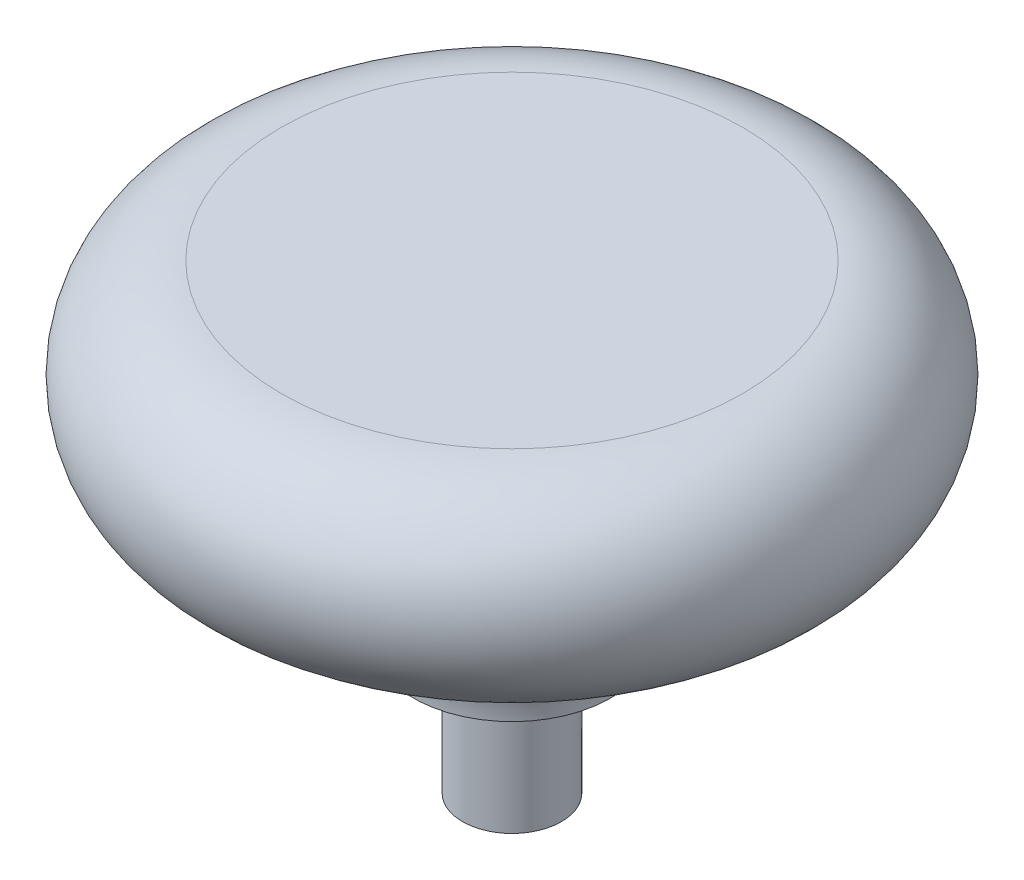
ISO-10303-21;
HEADER;
FILE_DESCRIPTION(('STEP AP214'),'2;1');
FILE_NAME('part.step','',(''),(''),'','','');
FILE_SCHEMA(('AUTOMOTIVE_DESIGN { 1 0 10303 214 1 1 1 1 }'));
ENDSEC;
DATA;
#1=APPLICATION_CONTEXT('core data for automotive mechanical design processes');
#2=APPLICATION_PROTOCOL_DEFINITION('international standard','automotive_design',2000,#1);
#3=PRODUCT_CONTEXT('',#1,'mechanical');
#4=PRODUCT('Part','Part','',(#3));
#5=PRODUCT_RELATED_PRODUCT_CATEGORY('part','',(#4));
#6=PRODUCT_DEFINITION_FORMATION('','',#4);
#7=PRODUCT_DEFINITION_CONTEXT('part definition',#1,'design');
#8=PRODUCT_DEFINITION('design','',#6,#7);
#9=PRODUCT_DEFINITION_SHAPE('','',#8);
#10=(LENGTH_UNIT() NAMED_UNIT(*) SI_UNIT(.MILLI.,.METRE.));
#11=(NAMED_UNIT(*) PLANE_ANGLE_UNIT() SI_UNIT($,.RADIAN.));
#12=(NAMED_UNIT(*) SI_UNIT($,.STERADIAN.) SOLID_ANGLE_UNIT());
#13=UNCERTAINTY_MEASURE_WITH_UNIT(LENGTH_MEASURE(1.E-05),#10,'distance_accuracy_value','');
#14=(GEOMETRIC_REPRESENTATION_CONTEXT(3) GLOBAL_UNCERTAINTY_ASSIGNED_CONTEXT((#13)) GLOBAL_UNIT_ASSIGNED_CONTEXT((#10,
#11,#12)) REPRESENTATION_CONTEXT('',''));
#15=CARTESIAN_POINT('',(0.,0.,0.));
#16=DIRECTION('',(0.,0.,1.));
#17=DIRECTION('',(1.,0.,0.));
#18=AXIS2_PLACEMENT_3D('',#15,#16,#17);
#19=CARTESIAN_POINT('',(2.38125,0.,0.));
#20=DIRECTION('',(0.,1.,0.));
#21=DIRECTION('',(0.,0.,1.));
#22=AXIS2_PLACEMENT_3D('',#19,#20,#21);
#23=PLANE('',#22);
#24=CARTESIAN_POINT('',(0.,0.,0.));
#25=DIRECTION('',(0.,-1.,0.));
#26=DIRECTION('',(0.,0.,-1.));
#27=AXIS2_PLACEMENT_3D('',#24,#25,#26);
#28=CIRCLE('',#27,2.38125);
#29=CARTESIAN_POINT('',(0.,0.,-2.38125));
#30=VERTEX_POINT('',#29);
#31=EDGE_CURVE('E52',#30,#30,#28,.T.);
#32=ORIENTED_EDGE('',*,*,#31,.T.);
#33=EDGE_LOOP('',(#32));
#34=FACE_BOUND('',#33,.T.);
#35=ADVANCED_FACE('F33',(#34),#23,.F.);
#36=CARTESIAN_POINT('',(0.,22.225,0.));
#37=DIRECTION('',(0.,-1.,0.));
#38=DIRECTION('',(0.,0.,-1.));
#39=AXIS2_PLACEMENT_3D('',#36,#37,#38);
#40=PLANE('',#39);
#41=CARTESIAN_POINT('',(0.,22.225,0.));
#42=DIRECTION('',(0.,-1.,0.));
#43=DIRECTION('',(0.,0.,-1.));
#44=AXIS2_PLACEMENT_3D('',#41,#42,#43);
#45=CIRCLE('',#44,11.1125);
#46=CARTESIAN_POINT('',(0.,22.225,-11.1125));
#47=VERTEX_POINT('',#46);
#48=EDGE_CURVE('E10',#47,#47,#45,.T.);
#49=ORIENTED_EDGE('',*,*,#48,.F.);
#50=EDGE_LOOP('',(#49));
#51=FACE_BOUND('',#50,.T.);
#52=ADVANCED_FACE('F76',(#51),#40,.F.);
#53=CARTESIAN_POINT('',(0.,17.4625,0.));
#54=DIRECTION('',(0.,-1.,0.));
#55=DIRECTION('',(0.,0.,-1.));
#56=AXIS2_PLACEMENT_3D('',#53,#54,#55);
#57=TOROIDAL_SURFACE('',#56,11.1125,4.7625);
#58=CARTESIAN_POINT('',(0.,12.7,0.));
#59=DIRECTION('',(0.,-1.,0.));
#60=DIRECTION('',(0.,0.,-1.));
#61=AXIS2_PLACEMENT_3D('',#58,#59,#60);
#62=CIRCLE('',#61,11.1125);
#63=CARTESIAN_POINT('',(0.,12.7,-11.1125));
#64=VERTEX_POINT('',#63);
#65=EDGE_CURVE('E39',#64,#64,#62,.T.);
#66=ORIENTED_EDGE('',*,*,#65,.F.);
#67=EDGE_LOOP('',(#66));
#68=FACE_BOUND('',#67,.T.);
#69=ORIENTED_EDGE('',*,*,#48,.T.);
#70=EDGE_LOOP('',(#69));
#71=FACE_BOUND('',#70,.T.);
#72=ADVANCED_FACE('F71',(#68,#71),#57,.T.);
#73=CARTESIAN_POINT('',(0.,6.35,0.));
#74=DIRECTION('',(0.,-1.,0.));
#75=DIRECTION('',(0.,0.,-1.));
#76=AXIS2_PLACEMENT_3D('',#73,#74,#75);
#77=TOROIDAL_SURFACE('',#76,11.1125,6.35);
#78=CARTESIAN_POINT('',(0.,6.35,0.));
#79=DIRECTION('',(0.,-1.,0.));
#80=DIRECTION('',(0.,0.,-1.));
#81=AXIS2_PLACEMENT_3D('',#78,#79,#80);
#82=CIRCLE('',#81,4.7625);
#83=CARTESIAN_POINT('',(0.,6.35,-4.7625));
#84=VERTEX_POINT('',#83);
#85=EDGE_CURVE('E43',#84,#84,#82,.T.);
#86=ORIENTED_EDGE('',*,*,#85,.F.);
#87=EDGE_LOOP('',(#86));
#88=FACE_BOUND('',#87,.T.);
#89=ORIENTED_EDGE('',*,*,#65,.T.);
#90=EDGE_LOOP('',(#89));
#91=FACE_BOUND('',#90,.T.);
#92=ADVANCED_FACE('F66',(#88,#91),#77,.F.);
#93=CARTESIAN_POINT('',(4.7625,6.35,0.));
#94=DIRECTION('',(0.,1.,0.));
#95=DIRECTION('',(0.,0.,1.));
#96=AXIS2_PLACEMENT_3D('',#93,#94,#95);
#97=PLANE('',#96);
#98=CARTESIAN_POINT('',(0.,6.35,0.));
#99=DIRECTION('',(0.,-1.,0.));
#100=DIRECTION('',(0.,0.,-1.));
#101=AXIS2_PLACEMENT_3D('',#98,#99,#100);
#102=CIRCLE('',#101,2.38125);
#103=CARTESIAN_POINT('',(0.,6.35,-2.38125));
#104=VERTEX_POINT('',#103);
#105=EDGE_CURVE('E47',#104,#104,#102,.T.);
#106=ORIENTED_EDGE('',*,*,#105,.F.);
#107=EDGE_LOOP('',(#106));
#108=FACE_BOUND('',#107,.T.);
#109=ORIENTED_EDGE('',*,*,#85,.T.);
#110=EDGE_LOOP('',(#109));
#111=FACE_BOUND('',#110,.T.);
#112=ADVANCED_FACE('F60',(#108,#111),#97,.F.);
#113=CARTESIAN_POINT('',(0.,0.,0.));
#114=DIRECTION('',(0.,-1.,0.));
#115=DIRECTION('',(0.,0.,-1.));
#116=AXIS2_PLACEMENT_3D('',#113,#114,#115);
#117=CYLINDRICAL_SURFACE('',#116,2.38125);
#118=ORIENTED_EDGE('',*,*,#31,.F.);
#119=EDGE_LOOP('',(#118));
#120=FACE_BOUND('',#119,.T.);
#121=ORIENTED_EDGE('',*,*,#105,.T.);
#122=EDGE_LOOP('',(#121));
#123=FACE_BOUND('',#122,.T.);
#124=ADVANCED_FACE('F57',(#120,#123),#117,.T.);
#125=CLOSED_SHELL('',(#35,#52,#72,#92,#112,#124));
#126=MANIFOLD_SOLID_BREP('B2',#125);
#127=ADVANCED_BREP_SHAPE_REPRESENTATION('',(#18,#126),#14);
#128=SHAPE_DEFINITION_REPRESENTATION(#9,#127);
ENDSEC;
END-ISO-10303-21;
